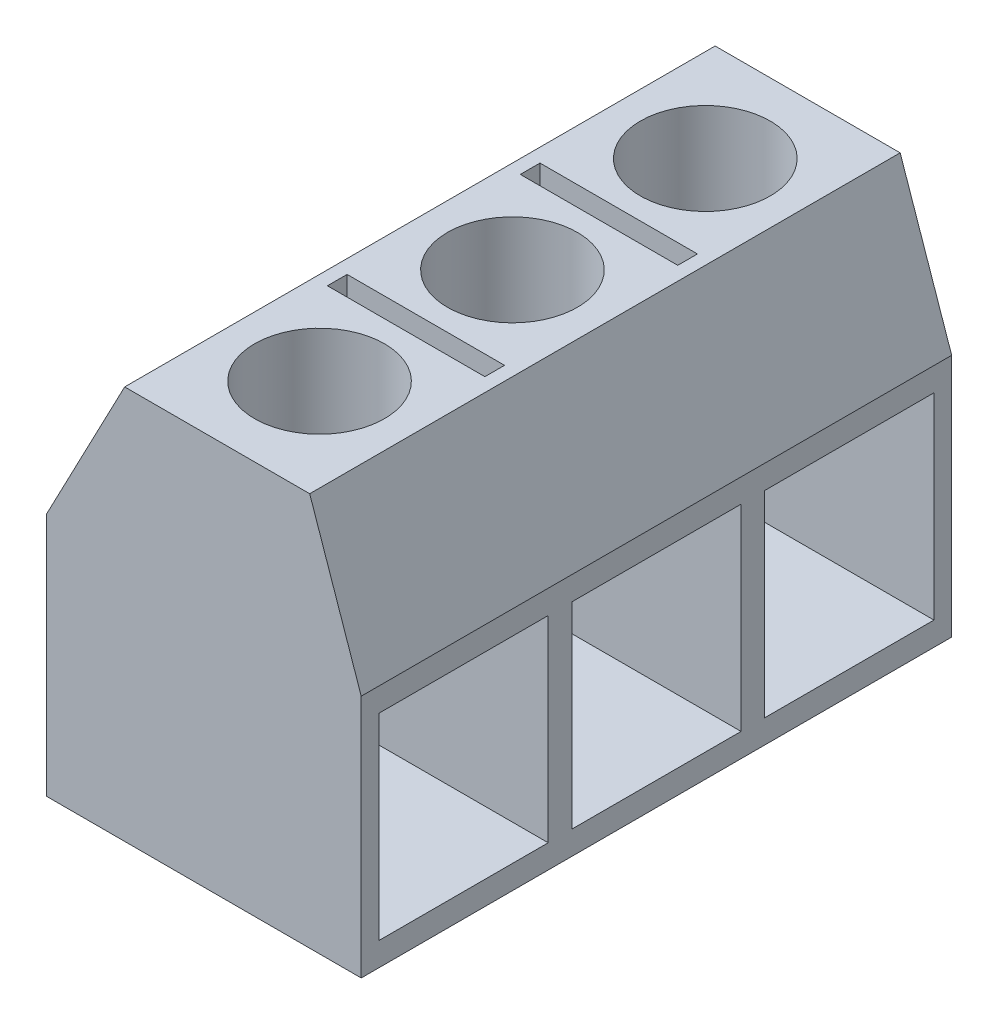
ISO-10303-21;
HEADER;
FILE_DESCRIPTION(('STEP AP214'),'2;1');
FILE_NAME('part.step','',(''),(''),'','','');
FILE_SCHEMA(('AUTOMOTIVE_DESIGN { 1 0 10303 214 1 1 1 1 }'));
ENDSEC;
DATA;
#1=APPLICATION_CONTEXT('core data for automotive mechanical design processes');
#2=APPLICATION_PROTOCOL_DEFINITION('international standard','automotive_design',2000,#1);
#3=PRODUCT_CONTEXT('',#1,'mechanical');
#4=PRODUCT('Part','Part','',(#3));
#5=PRODUCT_RELATED_PRODUCT_CATEGORY('part','',(#4));
#6=PRODUCT_DEFINITION_FORMATION('','',#4);
#7=PRODUCT_DEFINITION_CONTEXT('part definition',#1,'design');
#8=PRODUCT_DEFINITION('design','',#6,#7);
#9=PRODUCT_DEFINITION_SHAPE('','',#8);
#10=(LENGTH_UNIT() NAMED_UNIT(*) SI_UNIT(.MILLI.,.METRE.));
#11=(NAMED_UNIT(*) PLANE_ANGLE_UNIT() SI_UNIT($,.RADIAN.));
#12=(NAMED_UNIT(*) SI_UNIT($,.STERADIAN.) SOLID_ANGLE_UNIT());
#13=UNCERTAINTY_MEASURE_WITH_UNIT(LENGTH_MEASURE(1.E-05),#10,'distance_accuracy_value','');
#14=(GEOMETRIC_REPRESENTATION_CONTEXT(3) GLOBAL_UNCERTAINTY_ASSIGNED_CONTEXT((#13)) GLOBAL_UNIT_ASSIGNED_CONTEXT((#10,
#11,#12)) REPRESENTATION_CONTEXT('',''));
#15=CARTESIAN_POINT('',(0.,0.,0.));
#16=DIRECTION('',(0.,0.,1.));
#17=DIRECTION('',(1.,0.,0.));
#18=AXIS2_PLACEMENT_3D('',#15,#16,#17);
#19=CARTESIAN_POINT('',(-3.80327868852459,6.2,15.));
#20=DIRECTION('',(1.,0.,0.));
#21=DIRECTION('',(0.,1.,0.));
#22=AXIS2_PLACEMENT_3D('',#19,#20,#21);
#23=PLANE('',#22);
#24=DIRECTION('',(0.,-1.,0.));
#25=VECTOR('',#24,1.);
#26=CARTESIAN_POINT('',(-3.80327868852459,6.2,0.));
#27=LINE('',#26,#25);
#28=CARTESIAN_POINT('',(-3.80327868852459,6.2,0.));
#29=VERTEX_POINT('',#28);
#30=CARTESIAN_POINT('',(-3.80327868852458,0.,0.));
#31=VERTEX_POINT('',#30);
#32=EDGE_CURVE('E313',#29,#31,#27,.T.);
#33=ORIENTED_EDGE('',*,*,#32,.T.);
#34=DIRECTION('',(0.,0.,-1.));
#35=VECTOR('',#34,1.);
#36=CARTESIAN_POINT('',(-3.80327868852458,0.,15.));
#37=LINE('',#36,#35);
#38=CARTESIAN_POINT('',(-3.80327868852458,0.,15.));
#39=VERTEX_POINT('',#38);
#40=EDGE_CURVE('E11',#39,#31,#37,.T.);
#41=ORIENTED_EDGE('',*,*,#40,.F.);
#42=DIRECTION('',(0.,-1.,0.));
#43=VECTOR('',#42,1.);
#44=CARTESIAN_POINT('',(-3.80327868852459,6.2,15.));
#45=LINE('',#44,#43);
#46=CARTESIAN_POINT('',(-3.80327868852459,6.2,15.));
#47=VERTEX_POINT('',#46);
#48=EDGE_CURVE('E384',#47,#39,#45,.T.);
#49=ORIENTED_EDGE('',*,*,#48,.F.);
#50=DIRECTION('',(0.,0.,-1.));
#51=VECTOR('',#50,1.);
#52=CARTESIAN_POINT('',(-3.80327868852459,6.2,15.));
#53=LINE('',#52,#51);
#54=EDGE_CURVE('E398',#47,#29,#53,.T.);
#55=ORIENTED_EDGE('',*,*,#54,.T.);
#56=EDGE_LOOP('',(#33,#41,#49,#55));
#57=FACE_BOUND('',#56,.T.);
#58=ADVANCED_FACE('F34',(#57),#23,.F.);
#59=CARTESIAN_POINT('',(-3.80327868852458,0.,15.));
#60=DIRECTION('',(0.,1.,0.));
#61=DIRECTION('',(0.,0.,1.));
#62=AXIS2_PLACEMENT_3D('',#59,#60,#61);
#63=PLANE('',#62);
#64=DIRECTION('',(1.,0.,0.));
#65=VECTOR('',#64,1.);
#66=CARTESIAN_POINT('',(-3.80327868852458,0.,0.));
#67=LINE('',#66,#65);
#68=CARTESIAN_POINT('',(4.19672131147542,0.,0.));
#69=VERTEX_POINT('',#68);
#70=EDGE_CURVE('E401',#31,#69,#67,.T.);
#71=ORIENTED_EDGE('',*,*,#70,.T.);
#72=DIRECTION('',(0.,0.,-1.));
#73=VECTOR('',#72,1.);
#74=CARTESIAN_POINT('',(4.19672131147542,0.,15.));
#75=LINE('',#74,#73);
#76=CARTESIAN_POINT('',(4.19672131147542,0.,15.));
#77=VERTEX_POINT('',#76);
#78=EDGE_CURVE('E42',#77,#69,#75,.T.);
#79=ORIENTED_EDGE('',*,*,#78,.F.);
#80=DIRECTION('',(1.,0.,0.));
#81=VECTOR('',#80,1.);
#82=CARTESIAN_POINT('',(-3.80327868852458,0.,15.));
#83=LINE('',#82,#81);
#84=EDGE_CURVE('E387',#39,#77,#83,.T.);
#85=ORIENTED_EDGE('',*,*,#84,.F.);
#86=ORIENTED_EDGE('',*,*,#40,.T.);
#87=EDGE_LOOP('',(#71,#79,#85,#86));
#88=FACE_BOUND('',#87,.T.);
#89=ADVANCED_FACE('F453',(#88),#63,.F.);
#90=CARTESIAN_POINT('',(4.19672131147542,0.,15.));
#91=DIRECTION('',(-1.,0.,0.));
#92=DIRECTION('',(0.,0.,1.));
#93=AXIS2_PLACEMENT_3D('',#90,#91,#92);
#94=PLANE('',#93);
#95=DIRECTION('',(0.,0.,1.));
#96=VECTOR('',#95,1.);
#97=CARTESIAN_POINT('',(4.19672131147542,5.6,14.55));
#98=LINE('',#97,#96);
#99=CARTESIAN_POINT('',(4.19672131147542,5.6,10.25));
#100=VERTEX_POINT('',#99);
#101=CARTESIAN_POINT('',(4.19672131147542,5.6,14.55));
#102=VERTEX_POINT('',#101);
#103=EDGE_CURVE('E238',#100,#102,#98,.T.);
#104=ORIENTED_EDGE('',*,*,#103,.F.);
#105=DIRECTION('',(0.,1.,0.));
#106=VECTOR('',#105,1.);
#107=CARTESIAN_POINT('',(4.19672131147542,5.6,10.25));
#108=LINE('',#107,#106);
#109=CARTESIAN_POINT('',(4.19672131147542,0.599999999999999,10.25));
#110=VERTEX_POINT('',#109);
#111=EDGE_CURVE('E50',#110,#100,#108,.T.);
#112=ORIENTED_EDGE('',*,*,#111,.F.);
#113=DIRECTION('',(0.,0.,-1.));
#114=VECTOR('',#113,1.);
#115=CARTESIAN_POINT('',(4.19672131147542,0.599999999999999,14.55));
#116=LINE('',#115,#114);
#117=CARTESIAN_POINT('',(4.19672131147542,0.599999999999999,14.55));
#118=VERTEX_POINT('',#117);
#119=EDGE_CURVE('E229',#118,#110,#116,.T.);
#120=ORIENTED_EDGE('',*,*,#119,.F.);
#121=DIRECTION('',(0.,-1.,0.));
#122=VECTOR('',#121,1.);
#123=CARTESIAN_POINT('',(4.19672131147542,5.6,14.55));
#124=LINE('',#123,#122);
#125=EDGE_CURVE('E232',#102,#118,#124,.T.);
#126=ORIENTED_EDGE('',*,*,#125,.F.);
#127=EDGE_LOOP('',(#104,#112,#120,#126));
#128=FACE_BOUND('',#127,.T.);
#129=DIRECTION('',(0.,1.,0.));
#130=VECTOR('',#129,1.);
#131=CARTESIAN_POINT('',(4.19672131147542,5.6,5.35));
#132=LINE('',#131,#130);
#133=CARTESIAN_POINT('',(4.19672131147542,0.6,5.35));
#134=VERTEX_POINT('',#133);
#135=CARTESIAN_POINT('',(4.19672131147542,5.6,5.35));
#136=VERTEX_POINT('',#135);
#137=EDGE_CURVE('E264',#134,#136,#132,.T.);
#138=ORIENTED_EDGE('',*,*,#137,.F.);
#139=DIRECTION('',(0.,0.,-1.));
#140=VECTOR('',#139,1.);
#141=CARTESIAN_POINT('',(4.19672131147542,0.599999999999999,9.65));
#142=LINE('',#141,#140);
#143=CARTESIAN_POINT('',(4.19672131147542,0.599999999999999,9.65));
#144=VERTEX_POINT('',#143);
#145=EDGE_CURVE('E58',#144,#134,#142,.T.);
#146=ORIENTED_EDGE('',*,*,#145,.F.);
#147=DIRECTION('',(0.,-1.,0.));
#148=VECTOR('',#147,1.);
#149=CARTESIAN_POINT('',(4.19672131147542,5.6,9.65));
#150=LINE('',#149,#148);
#151=CARTESIAN_POINT('',(4.19672131147542,5.6,9.65));
#152=VERTEX_POINT('',#151);
#153=EDGE_CURVE('E253',#152,#144,#150,.T.);
#154=ORIENTED_EDGE('',*,*,#153,.F.);
#155=DIRECTION('',(0.,0.,1.));
#156=VECTOR('',#155,1.);
#157=CARTESIAN_POINT('',(4.19672131147542,5.6,9.65));
#158=LINE('',#157,#156);
#159=EDGE_CURVE('E268',#136,#152,#158,.T.);
#160=ORIENTED_EDGE('',*,*,#159,.F.);
#161=EDGE_LOOP('',(#138,#146,#154,#160));
#162=FACE_BOUND('',#161,.T.);
#163=DIRECTION('',(0.,1.,0.));
#164=VECTOR('',#163,1.);
#165=CARTESIAN_POINT('',(4.19672131147542,5.6,0.449999999999996));
#166=LINE('',#165,#164);
#167=CARTESIAN_POINT('',(4.19672131147542,0.599999999999999,0.449999999999996));
#168=VERTEX_POINT('',#167);
#169=CARTESIAN_POINT('',(4.19672131147542,5.6,0.449999999999996));
#170=VERTEX_POINT('',#169);
#171=EDGE_CURVE('E295',#168,#170,#166,.T.);
#172=ORIENTED_EDGE('',*,*,#171,.F.);
#173=DIRECTION('',(0.,0.,-1.));
#174=VECTOR('',#173,1.);
#175=CARTESIAN_POINT('',(4.19672131147542,0.599999999999999,4.75));
#176=LINE('',#175,#174);
#177=CARTESIAN_POINT('',(4.19672131147542,0.599999999999999,4.75));
#178=VERTEX_POINT('',#177);
#179=EDGE_CURVE('E293',#178,#168,#176,.T.);
#180=ORIENTED_EDGE('',*,*,#179,.F.);
#181=DIRECTION('',(0.,-1.,0.));
#182=VECTOR('',#181,1.);
#183=CARTESIAN_POINT('',(4.19672131147542,5.6,4.75));
#184=LINE('',#183,#182);
#185=CARTESIAN_POINT('',(4.19672131147542,5.6,4.75));
#186=VERTEX_POINT('',#185);
#187=EDGE_CURVE('E283',#186,#178,#184,.T.);
#188=ORIENTED_EDGE('',*,*,#187,.F.);
#189=DIRECTION('',(0.,0.,1.));
#190=VECTOR('',#189,1.);
#191=CARTESIAN_POINT('',(4.19672131147542,5.6,4.75));
#192=LINE('',#191,#190);
#193=EDGE_CURVE('E298',#170,#186,#192,.T.);
#194=ORIENTED_EDGE('',*,*,#193,.F.);
#195=EDGE_LOOP('',(#172,#180,#188,#194));
#196=FACE_BOUND('',#195,.T.);
#197=DIRECTION('',(0.,1.,0.));
#198=VECTOR('',#197,1.);
#199=CARTESIAN_POINT('',(4.19672131147542,0.,0.));
#200=LINE('',#199,#198);
#201=CARTESIAN_POINT('',(4.19672131147542,6.2,0.));
#202=VERTEX_POINT('',#201);
#203=EDGE_CURVE('E403',#69,#202,#200,.T.);
#204=ORIENTED_EDGE('',*,*,#203,.T.);
#205=DIRECTION('',(0.,0.,-1.));
#206=VECTOR('',#205,1.);
#207=CARTESIAN_POINT('',(4.19672131147542,6.2,15.));
#208=LINE('',#207,#206);
#209=CARTESIAN_POINT('',(4.19672131147542,6.2,15.));
#210=VERTEX_POINT('',#209);
#211=EDGE_CURVE('E418',#210,#202,#208,.T.);
#212=ORIENTED_EDGE('',*,*,#211,.F.);
#213=DIRECTION('',(0.,1.,0.));
#214=VECTOR('',#213,1.);
#215=CARTESIAN_POINT('',(4.19672131147542,0.,15.));
#216=LINE('',#215,#214);
#217=EDGE_CURVE('E390',#77,#210,#216,.T.);
#218=ORIENTED_EDGE('',*,*,#217,.F.);
#219=ORIENTED_EDGE('',*,*,#78,.T.);
#220=EDGE_LOOP('',(#204,#212,#218,#219));
#221=FACE_BOUND('',#220,.T.);
#222=ADVANCED_FACE('F458',(#128,#162,#196,#221),#94,.F.);
#223=CARTESIAN_POINT('',(4.19672131147542,6.2,15.));
#224=DIRECTION('',(-0.945476419668395,-0.325690558430901,0.));
#225=DIRECTION('',(0.325690558430901,-0.945476419668395,0.));
#226=AXIS2_PLACEMENT_3D('',#223,#224,#225);
#227=PLANE('',#226);
#228=DIRECTION('',(-0.325690558430901,0.945476419668395,0.));
#229=VECTOR('',#228,1.);
#230=CARTESIAN_POINT('',(4.19672131147542,6.2,0.));
#231=LINE('',#230,#229);
#232=CARTESIAN_POINT('',(2.88772608294132,10.,0.));
#233=VERTEX_POINT('',#232);
#234=EDGE_CURVE('E405',#202,#233,#231,.T.);
#235=ORIENTED_EDGE('',*,*,#234,.T.);
#236=DIRECTION('',(0.,0.,-1.));
#237=VECTOR('',#236,1.);
#238=CARTESIAN_POINT('',(2.88772608294132,10.,15.));
#239=LINE('',#238,#237);
#240=CARTESIAN_POINT('',(2.88772608294132,10.,15.));
#241=VERTEX_POINT('',#240);
#242=EDGE_CURVE('E415',#241,#233,#239,.T.);
#243=ORIENTED_EDGE('',*,*,#242,.F.);
#244=DIRECTION('',(-0.325690558430901,0.945476419668395,0.));
#245=VECTOR('',#244,1.);
#246=CARTESIAN_POINT('',(4.19672131147542,6.2,15.));
#247=LINE('',#246,#245);
#248=EDGE_CURVE('E392',#210,#241,#247,.T.);
#249=ORIENTED_EDGE('',*,*,#248,.F.);
#250=ORIENTED_EDGE('',*,*,#211,.T.);
#251=EDGE_LOOP('',(#235,#243,#249,#250));
#252=FACE_BOUND('',#251,.T.);
#253=ADVANCED_FACE('F483',(#252),#227,.F.);
#254=CARTESIAN_POINT('',(2.88772608294132,10.,15.));
#255=DIRECTION('',(0.,-1.,0.));
#256=DIRECTION('',(1.,0.,0.));
#257=AXIS2_PLACEMENT_3D('',#254,#255,#256);
#258=PLANE('',#257);
#259=CARTESIAN_POINT('',(0.537726082941324,10.,12.4));
#260=DIRECTION('',(0.,1.,0.));
#261=DIRECTION('',(-1.,0.,0.));
#262=AXIS2_PLACEMENT_3D('',#259,#260,#261);
#263=CIRCLE('',#262,1.65);
#264=CARTESIAN_POINT('',(-1.11227391705868,10.,12.4));
#265=VERTEX_POINT('',#264);
#266=EDGE_CURVE('E310',#265,#265,#263,.T.);
#267=ORIENTED_EDGE('',*,*,#266,.F.);
#268=EDGE_LOOP('',(#267));
#269=FACE_BOUND('',#268,.T.);
#270=DIRECTION('',(1.,0.,0.));
#271=VECTOR('',#270,1.);
#272=CARTESIAN_POINT('',(-1.46227391705868,10.,10.2));
#273=LINE('',#272,#271);
#274=CARTESIAN_POINT('',(-1.46227391705868,10.,10.2));
#275=VERTEX_POINT('',#274);
#276=CARTESIAN_POINT('',(2.53772608294132,10.,10.2));
#277=VERTEX_POINT('',#276);
#278=EDGE_CURVE('E331',#275,#277,#273,.T.);
#279=ORIENTED_EDGE('',*,*,#278,.F.);
#280=DIRECTION('',(0.,0.,1.));
#281=VECTOR('',#280,1.);
#282=CARTESIAN_POINT('',(-1.46227391705868,10.,10.2));
#283=LINE('',#282,#281);
#284=CARTESIAN_POINT('',(-1.46227391705868,10.,9.7));
#285=VERTEX_POINT('',#284);
#286=EDGE_CURVE('E329',#285,#275,#283,.T.);
#287=ORIENTED_EDGE('',*,*,#286,.F.);
#288=DIRECTION('',(-1.,0.,0.));
#289=VECTOR('',#288,1.);
#290=CARTESIAN_POINT('',(-1.46227391705868,10.,9.7));
#291=LINE('',#290,#289);
#292=CARTESIAN_POINT('',(2.53772608294132,10.,9.7));
#293=VERTEX_POINT('',#292);
#294=EDGE_CURVE('E319',#293,#285,#291,.T.);
#295=ORIENTED_EDGE('',*,*,#294,.F.);
#296=DIRECTION('',(0.,0.,-1.));
#297=VECTOR('',#296,1.);
#298=CARTESIAN_POINT('',(2.53772608294132,10.,10.2));
#299=LINE('',#298,#297);
#300=EDGE_CURVE('E335',#277,#293,#299,.T.);
#301=ORIENTED_EDGE('',*,*,#300,.F.);
#302=EDGE_LOOP('',(#279,#287,#295,#301));
#303=FACE_BOUND('',#302,.T.);
#304=CARTESIAN_POINT('',(0.537726082941324,10.,7.5));
#305=DIRECTION('',(0.,1.,0.));
#306=DIRECTION('',(-1.,0.,0.));
#307=AXIS2_PLACEMENT_3D('',#304,#305,#306);
#308=CIRCLE('',#307,1.65);
#309=CARTESIAN_POINT('',(-1.11227391705868,10.,7.5));
#310=VERTEX_POINT('',#309);
#311=EDGE_CURVE('E332',#310,#310,#308,.T.);
#312=ORIENTED_EDGE('',*,*,#311,.F.);
#313=EDGE_LOOP('',(#312));
#314=FACE_BOUND('',#313,.T.);
#315=DIRECTION('',(1.,0.,0.));
#316=VECTOR('',#315,1.);
#317=CARTESIAN_POINT('',(-1.46227391705868,10.,5.3));
#318=LINE('',#317,#316);
#319=CARTESIAN_POINT('',(-1.46227391705868,10.,5.3));
#320=VERTEX_POINT('',#319);
#321=CARTESIAN_POINT('',(2.53772608294132,10.,5.3));
#322=VERTEX_POINT('',#321);
#323=EDGE_CURVE('E366',#320,#322,#318,.T.);
#324=ORIENTED_EDGE('',*,*,#323,.F.);
#325=DIRECTION('',(0.,0.,1.));
#326=VECTOR('',#325,1.);
#327=CARTESIAN_POINT('',(-1.46227391705868,10.,5.3));
#328=LINE('',#327,#326);
#329=CARTESIAN_POINT('',(-1.46227391705868,10.,4.8));
#330=VERTEX_POINT('',#329);
#331=EDGE_CURVE('E364',#330,#320,#328,.T.);
#332=ORIENTED_EDGE('',*,*,#331,.F.);
#333=DIRECTION('',(-1.,0.,0.));
#334=VECTOR('',#333,1.);
#335=CARTESIAN_POINT('',(-1.46227391705868,10.,4.8));
#336=LINE('',#335,#334);
#337=CARTESIAN_POINT('',(2.53772608294132,10.,4.8));
#338=VERTEX_POINT('',#337);
#339=EDGE_CURVE('E354',#338,#330,#336,.T.);
#340=ORIENTED_EDGE('',*,*,#339,.F.);
#341=DIRECTION('',(0.,0.,-1.));
#342=VECTOR('',#341,1.);
#343=CARTESIAN_POINT('',(2.53772608294132,10.,5.3));
#344=LINE('',#343,#342);
#345=EDGE_CURVE('E370',#322,#338,#344,.T.);
#346=ORIENTED_EDGE('',*,*,#345,.F.);
#347=EDGE_LOOP('',(#324,#332,#340,#346));
#348=FACE_BOUND('',#347,.T.);
#349=CARTESIAN_POINT('',(0.537726082941324,10.,2.6));
#350=DIRECTION('',(0.,1.,0.));
#351=DIRECTION('',(-1.,0.,0.));
#352=AXIS2_PLACEMENT_3D('',#349,#350,#351);
#353=CIRCLE('',#352,1.65);
#354=CARTESIAN_POINT('',(-1.11227391705868,10.,2.6));
#355=VERTEX_POINT('',#354);
#356=EDGE_CURVE('E367',#355,#355,#353,.T.);
#357=ORIENTED_EDGE('',*,*,#356,.F.);
#358=EDGE_LOOP('',(#357));
#359=FACE_BOUND('',#358,.T.);
#360=DIRECTION('',(-1.,0.,0.));
#361=VECTOR('',#360,1.);
#362=CARTESIAN_POINT('',(2.88772608294132,10.,0.));
#363=LINE('',#362,#361);
#364=CARTESIAN_POINT('',(-1.81227391705868,10.,0.));
#365=VERTEX_POINT('',#364);
#366=EDGE_CURVE('E407',#233,#365,#363,.T.);
#367=ORIENTED_EDGE('',*,*,#366,.T.);
#368=DIRECTION('',(0.,0.,-1.));
#369=VECTOR('',#368,1.);
#370=CARTESIAN_POINT('',(-1.81227391705868,10.,15.));
#371=LINE('',#370,#369);
#372=CARTESIAN_POINT('',(-1.81227391705868,10.,15.));
#373=VERTEX_POINT('',#372);
#374=EDGE_CURVE('E412',#373,#365,#371,.T.);
#375=ORIENTED_EDGE('',*,*,#374,.F.);
#376=DIRECTION('',(-1.,0.,0.));
#377=VECTOR('',#376,1.);
#378=CARTESIAN_POINT('',(2.88772608294132,10.,15.));
#379=LINE('',#378,#377);
#380=EDGE_CURVE('E394',#241,#373,#379,.T.);
#381=ORIENTED_EDGE('',*,*,#380,.F.);
#382=ORIENTED_EDGE('',*,*,#242,.T.);
#383=EDGE_LOOP('',(#367,#375,#381,#382));
#384=FACE_BOUND('',#383,.T.);
#385=ADVANCED_FACE('F480',(#269,#303,#314,#348,#359,#384),#258,.F.);
#386=CARTESIAN_POINT('',(-1.81227391705868,10.,15.));
#387=DIRECTION('',(0.885780885780885,-0.46410367633238,0.));
#388=DIRECTION('',(0.46410367633238,0.885780885780885,0.));
#389=AXIS2_PLACEMENT_3D('',#386,#387,#388);
#390=PLANE('',#389);
#391=DIRECTION('',(-0.46410367633238,-0.885780885780885,0.));
#392=VECTOR('',#391,1.);
#393=CARTESIAN_POINT('',(-1.81227391705868,10.,0.));
#394=LINE('',#393,#392);
#395=EDGE_CURVE('E388',#365,#29,#394,.T.);
#396=ORIENTED_EDGE('',*,*,#395,.T.);
#397=ORIENTED_EDGE('',*,*,#54,.F.);
#398=DIRECTION('',(-0.46410367633238,-0.885780885780885,0.));
#399=VECTOR('',#398,1.);
#400=CARTESIAN_POINT('',(-1.81227391705868,10.,15.));
#401=LINE('',#400,#399);
#402=EDGE_CURVE('E396',#373,#47,#401,.T.);
#403=ORIENTED_EDGE('',*,*,#402,.F.);
#404=ORIENTED_EDGE('',*,*,#374,.T.);
#405=EDGE_LOOP('',(#396,#397,#403,#404));
#406=FACE_BOUND('',#405,.T.);
#407=ADVANCED_FACE('F478',(#406),#390,.F.);
#408=CARTESIAN_POINT('',(0.,0.,15.));
#409=DIRECTION('',(0.,0.,1.));
#410=DIRECTION('',(1.,0.,0.));
#411=AXIS2_PLACEMENT_3D('',#408,#409,#410);
#412=PLANE('',#411);
#413=ORIENTED_EDGE('',*,*,#48,.T.);
#414=ORIENTED_EDGE('',*,*,#84,.T.);
#415=ORIENTED_EDGE('',*,*,#217,.T.);
#416=ORIENTED_EDGE('',*,*,#248,.T.);
#417=ORIENTED_EDGE('',*,*,#380,.T.);
#418=ORIENTED_EDGE('',*,*,#402,.T.);
#419=EDGE_LOOP('',(#413,#414,#415,#416,#417,#418));
#420=FACE_BOUND('',#419,.T.);
#421=ADVANCED_FACE('F473',(#420),#412,.T.);
#422=CARTESIAN_POINT('',(0.,0.,0.));
#423=DIRECTION('',(0.,0.,1.));
#424=DIRECTION('',(1.,0.,0.));
#425=AXIS2_PLACEMENT_3D('',#422,#423,#424);
#426=PLANE('',#425);
#427=ORIENTED_EDGE('',*,*,#32,.F.);
#428=ORIENTED_EDGE('',*,*,#395,.F.);
#429=ORIENTED_EDGE('',*,*,#366,.F.);
#430=ORIENTED_EDGE('',*,*,#234,.F.);
#431=ORIENTED_EDGE('',*,*,#203,.F.);
#432=ORIENTED_EDGE('',*,*,#70,.F.);
#433=EDGE_LOOP('',(#427,#428,#429,#430,#431,#432));
#434=FACE_BOUND('',#433,.T.);
#435=ADVANCED_FACE('F466',(#434),#426,.F.);
#436=CARTESIAN_POINT('',(0.537726082941328,0.799999999999999,2.6));
#437=DIRECTION('',(0.,1.,0.));
#438=DIRECTION('',(-1.,0.,0.));
#439=AXIS2_PLACEMENT_3D('',#436,#437,#438);
#440=CYLINDRICAL_SURFACE('',#439,1.65);
#441=CARTESIAN_POINT('',(0.537726082941326,5.6,2.6));
#442=DIRECTION('',(0.,1.,0.));
#443=DIRECTION('',(0.,0.,1.));
#444=AXIS2_PLACEMENT_3D('',#441,#442,#443);
#445=CIRCLE('',#444,1.65);
#446=CARTESIAN_POINT('',(0.537726082941326,5.6,4.25));
#447=VERTEX_POINT('',#446);
#448=EDGE_CURVE('E37',#447,#447,#445,.F.);
#449=ORIENTED_EDGE('',*,*,#448,.T.);
#450=EDGE_LOOP('',(#449));
#451=FACE_BOUND('',#450,.T.);
#452=ORIENTED_EDGE('',*,*,#356,.T.);
#453=EDGE_LOOP('',(#452));
#454=FACE_BOUND('',#453,.T.);
#455=ADVANCED_FACE('F431',(#451,#454),#440,.F.);
#456=CARTESIAN_POINT('',(-1.46227391705867,0.799999999999999,5.3));
#457=DIRECTION('',(-1.,0.,0.));
#458=DIRECTION('',(0.,-1.,0.));
#459=AXIS2_PLACEMENT_3D('',#456,#457,#458);
#460=PLANE('',#459);
#461=ORIENTED_EDGE('',*,*,#331,.T.);
#462=DIRECTION('',(0.,1.,0.));
#463=VECTOR('',#462,1.);
#464=CARTESIAN_POINT('',(-1.46227391705867,0.799999999999999,5.3));
#465=LINE('',#464,#463);
#466=CARTESIAN_POINT('',(-1.46227391705867,0.799999999999999,5.3));
#467=VERTEX_POINT('',#466);
#468=EDGE_CURVE('E363',#467,#320,#465,.T.);
#469=ORIENTED_EDGE('',*,*,#468,.F.);
#470=DIRECTION('',(0.,0.,1.));
#471=VECTOR('',#470,1.);
#472=CARTESIAN_POINT('',(-1.46227391705867,0.799999999999999,5.3));
#473=LINE('',#472,#471);
#474=CARTESIAN_POINT('',(-1.46227391705867,0.799999999999999,4.8));
#475=VERTEX_POINT('',#474);
#476=EDGE_CURVE('E350',#475,#467,#473,.T.);
#477=ORIENTED_EDGE('',*,*,#476,.F.);
#478=DIRECTION('',(0.,1.,0.));
#479=VECTOR('',#478,1.);
#480=CARTESIAN_POINT('',(-1.46227391705867,0.799999999999999,4.8));
#481=LINE('',#480,#479);
#482=EDGE_CURVE('E349',#475,#330,#481,.T.);
#483=ORIENTED_EDGE('',*,*,#482,.T.);
#484=EDGE_LOOP('',(#461,#469,#477,#483));
#485=FACE_BOUND('',#484,.T.);
#486=ADVANCED_FACE('F507',(#485),#460,.F.);
#487=CARTESIAN_POINT('',(-1.46227391705867,0.799999999999999,4.8));
#488=DIRECTION('',(0.,0.,-1.));
#489=DIRECTION('',(-1.,0.,0.));
#490=AXIS2_PLACEMENT_3D('',#487,#488,#489);
#491=PLANE('',#490);
#492=ORIENTED_EDGE('',*,*,#339,.T.);
#493=ORIENTED_EDGE('',*,*,#482,.F.);
#494=DIRECTION('',(-1.,0.,0.));
#495=VECTOR('',#494,1.);
#496=CARTESIAN_POINT('',(-1.46227391705867,0.799999999999999,4.8));
#497=LINE('',#496,#495);
#498=CARTESIAN_POINT('',(2.53772608294133,0.8,4.8));
#499=VERTEX_POINT('',#498);
#500=EDGE_CURVE('E360',#499,#475,#497,.T.);
#501=ORIENTED_EDGE('',*,*,#500,.F.);
#502=DIRECTION('',(0.,1.,0.));
#503=VECTOR('',#502,1.);
#504=CARTESIAN_POINT('',(2.53772608294133,0.8,4.8));
#505=LINE('',#504,#503);
#506=EDGE_CURVE('E376',#499,#338,#505,.T.);
#507=ORIENTED_EDGE('',*,*,#506,.T.);
#508=EDGE_LOOP('',(#492,#493,#501,#507));
#509=FACE_BOUND('',#508,.T.);
#510=ADVANCED_FACE('F510',(#509),#491,.F.);
#511=CARTESIAN_POINT('',(2.53772608294133,0.8,5.3));
#512=DIRECTION('',(1.,0.,0.));
#513=DIRECTION('',(0.,1.,0.));
#514=AXIS2_PLACEMENT_3D('',#511,#512,#513);
#515=PLANE('',#514);
#516=ORIENTED_EDGE('',*,*,#345,.T.);
#517=ORIENTED_EDGE('',*,*,#506,.F.);
#518=DIRECTION('',(0.,0.,-1.));
#519=VECTOR('',#518,1.);
#520=CARTESIAN_POINT('',(2.53772608294133,0.8,5.3));
#521=LINE('',#520,#519);
#522=CARTESIAN_POINT('',(2.53772608294133,0.8,5.3));
#523=VERTEX_POINT('',#522);
#524=EDGE_CURVE('E357',#523,#499,#521,.T.);
#525=ORIENTED_EDGE('',*,*,#524,.F.);
#526=DIRECTION('',(0.,1.,0.));
#527=VECTOR('',#526,1.);
#528=CARTESIAN_POINT('',(2.53772608294133,0.8,5.3));
#529=LINE('',#528,#527);
#530=EDGE_CURVE('E378',#523,#322,#529,.T.);
#531=ORIENTED_EDGE('',*,*,#530,.T.);
#532=EDGE_LOOP('',(#516,#517,#525,#531));
#533=FACE_BOUND('',#532,.T.);
#534=ADVANCED_FACE('F516',(#533),#515,.F.);
#535=CARTESIAN_POINT('',(-1.46227391705867,0.799999999999999,5.3));
#536=DIRECTION('',(0.,0.,1.));
#537=DIRECTION('',(1.,0.,0.));
#538=AXIS2_PLACEMENT_3D('',#535,#536,#537);
#539=PLANE('',#538);
#540=ORIENTED_EDGE('',*,*,#323,.T.);
#541=ORIENTED_EDGE('',*,*,#530,.F.);
#542=DIRECTION('',(1.,0.,0.));
#543=VECTOR('',#542,1.);
#544=CARTESIAN_POINT('',(-1.46227391705867,0.799999999999999,5.3));
#545=LINE('',#544,#543);
#546=EDGE_CURVE('E353',#467,#523,#545,.T.);
#547=ORIENTED_EDGE('',*,*,#546,.F.);
#548=ORIENTED_EDGE('',*,*,#468,.T.);
#549=EDGE_LOOP('',(#540,#541,#547,#548));
#550=FACE_BOUND('',#549,.T.);
#551=ADVANCED_FACE('F512',(#550),#539,.F.);
#552=CARTESIAN_POINT('',(0.,0.799999999999999,0.));
#553=DIRECTION('',(0.,-1.,0.));
#554=DIRECTION('',(1.,0.,0.));
#555=AXIS2_PLACEMENT_3D('',#552,#553,#554);
#556=PLANE('',#555);
#557=ORIENTED_EDGE('',*,*,#476,.T.);
#558=ORIENTED_EDGE('',*,*,#546,.T.);
#559=ORIENTED_EDGE('',*,*,#524,.T.);
#560=ORIENTED_EDGE('',*,*,#500,.T.);
#561=EDGE_LOOP('',(#557,#558,#559,#560));
#562=FACE_BOUND('',#561,.T.);
#563=ADVANCED_FACE('F515',(#562),#556,.F.);
#564=CARTESIAN_POINT('',(0.537726082941328,0.799999999999999,7.5));
#565=DIRECTION('',(0.,1.,0.));
#566=DIRECTION('',(-1.,0.,0.));
#567=AXIS2_PLACEMENT_3D('',#564,#565,#566);
#568=CYLINDRICAL_SURFACE('',#567,1.65);
#569=CARTESIAN_POINT('',(0.537726082941326,5.6,7.5));
#570=DIRECTION('',(0.,1.,0.));
#571=DIRECTION('',(0.,0.,1.));
#572=AXIS2_PLACEMENT_3D('',#569,#570,#571);
#573=CIRCLE('',#572,1.65);
#574=CARTESIAN_POINT('',(0.537726082941326,5.6,9.15));
#575=VERTEX_POINT('',#574);
#576=EDGE_CURVE('E424',#575,#575,#573,.F.);
#577=ORIENTED_EDGE('',*,*,#576,.T.);
#578=EDGE_LOOP('',(#577));
#579=FACE_BOUND('',#578,.T.);
#580=ORIENTED_EDGE('',*,*,#311,.T.);
#581=EDGE_LOOP('',(#580));
#582=FACE_BOUND('',#581,.T.);
#583=ADVANCED_FACE('F526',(#579,#582),#568,.F.);
#584=CARTESIAN_POINT('',(-1.46227391705867,0.799999999999999,10.2));
#585=DIRECTION('',(-1.,0.,0.));
#586=DIRECTION('',(0.,-1.,0.));
#587=AXIS2_PLACEMENT_3D('',#584,#585,#586);
#588=PLANE('',#587);
#589=ORIENTED_EDGE('',*,*,#286,.T.);
#590=DIRECTION('',(0.,1.,0.));
#591=VECTOR('',#590,1.);
#592=CARTESIAN_POINT('',(-1.46227391705867,0.799999999999999,10.2));
#593=LINE('',#592,#591);
#594=CARTESIAN_POINT('',(-1.46227391705867,0.799999999999999,10.2));
#595=VERTEX_POINT('',#594);
#596=EDGE_CURVE('E328',#595,#275,#593,.T.);
#597=ORIENTED_EDGE('',*,*,#596,.F.);
#598=DIRECTION('',(0.,0.,1.));
#599=VECTOR('',#598,1.);
#600=CARTESIAN_POINT('',(-1.46227391705867,0.799999999999999,10.2));
#601=LINE('',#600,#599);
#602=CARTESIAN_POINT('',(-1.46227391705867,0.799999999999999,9.7));
#603=VERTEX_POINT('',#602);
#604=EDGE_CURVE('E315',#603,#595,#601,.T.);
#605=ORIENTED_EDGE('',*,*,#604,.F.);
#606=DIRECTION('',(0.,1.,0.));
#607=VECTOR('',#606,1.);
#608=CARTESIAN_POINT('',(-1.46227391705867,0.799999999999999,9.7));
#609=LINE('',#608,#607);
#610=EDGE_CURVE('E314',#603,#285,#609,.T.);
#611=ORIENTED_EDGE('',*,*,#610,.T.);
#612=EDGE_LOOP('',(#589,#597,#605,#611));
#613=FACE_BOUND('',#612,.T.);
#614=ADVANCED_FACE('F530',(#613),#588,.F.);
#615=CARTESIAN_POINT('',(-1.46227391705867,0.799999999999999,9.7));
#616=DIRECTION('',(0.,0.,-1.));
#617=DIRECTION('',(-1.,0.,0.));
#618=AXIS2_PLACEMENT_3D('',#615,#616,#617);
#619=PLANE('',#618);
#620=ORIENTED_EDGE('',*,*,#294,.T.);
#621=ORIENTED_EDGE('',*,*,#610,.F.);
#622=DIRECTION('',(-1.,0.,0.));
#623=VECTOR('',#622,1.);
#624=CARTESIAN_POINT('',(-1.46227391705867,0.799999999999999,9.7));
#625=LINE('',#624,#623);
#626=CARTESIAN_POINT('',(2.53772608294133,0.8,9.7));
#627=VERTEX_POINT('',#626);
#628=EDGE_CURVE('E325',#627,#603,#625,.T.);
#629=ORIENTED_EDGE('',*,*,#628,.F.);
#630=DIRECTION('',(0.,1.,0.));
#631=VECTOR('',#630,1.);
#632=CARTESIAN_POINT('',(2.53772608294133,0.8,9.7));
#633=LINE('',#632,#631);
#634=EDGE_CURVE('E341',#627,#293,#633,.T.);
#635=ORIENTED_EDGE('',*,*,#634,.T.);
#636=EDGE_LOOP('',(#620,#621,#629,#635));
#637=FACE_BOUND('',#636,.T.);
#638=ADVANCED_FACE('F533',(#637),#619,.F.);
#639=CARTESIAN_POINT('',(2.53772608294133,0.8,10.2));
#640=DIRECTION('',(1.,0.,0.));
#641=DIRECTION('',(0.,1.,0.));
#642=AXIS2_PLACEMENT_3D('',#639,#640,#641);
#643=PLANE('',#642);
#644=ORIENTED_EDGE('',*,*,#300,.T.);
#645=ORIENTED_EDGE('',*,*,#634,.F.);
#646=DIRECTION('',(0.,0.,-1.));
#647=VECTOR('',#646,1.);
#648=CARTESIAN_POINT('',(2.53772608294133,0.8,10.2));
#649=LINE('',#648,#647);
#650=CARTESIAN_POINT('',(2.53772608294133,0.8,10.2));
#651=VERTEX_POINT('',#650);
#652=EDGE_CURVE('E322',#651,#627,#649,.T.);
#653=ORIENTED_EDGE('',*,*,#652,.F.);
#654=DIRECTION('',(0.,1.,0.));
#655=VECTOR('',#654,1.);
#656=CARTESIAN_POINT('',(2.53772608294133,0.8,10.2));
#657=LINE('',#656,#655);
#658=EDGE_CURVE('E343',#651,#277,#657,.T.);
#659=ORIENTED_EDGE('',*,*,#658,.T.);
#660=EDGE_LOOP('',(#644,#645,#653,#659));
#661=FACE_BOUND('',#660,.T.);
#662=ADVANCED_FACE('F539',(#661),#643,.F.);
#663=CARTESIAN_POINT('',(-1.46227391705867,0.799999999999999,10.2));
#664=DIRECTION('',(0.,0.,1.));
#665=DIRECTION('',(1.,0.,0.));
#666=AXIS2_PLACEMENT_3D('',#663,#664,#665);
#667=PLANE('',#666);
#668=ORIENTED_EDGE('',*,*,#278,.T.);
#669=ORIENTED_EDGE('',*,*,#658,.F.);
#670=DIRECTION('',(1.,0.,0.));
#671=VECTOR('',#670,1.);
#672=CARTESIAN_POINT('',(-1.46227391705867,0.799999999999999,10.2));
#673=LINE('',#672,#671);
#674=EDGE_CURVE('E318',#595,#651,#673,.T.);
#675=ORIENTED_EDGE('',*,*,#674,.F.);
#676=ORIENTED_EDGE('',*,*,#596,.T.);
#677=EDGE_LOOP('',(#668,#669,#675,#676));
#678=FACE_BOUND('',#677,.T.);
#679=ADVANCED_FACE('F535',(#678),#667,.F.);
#680=CARTESIAN_POINT('',(0.,0.799999999999999,0.));
#681=DIRECTION('',(0.,-1.,0.));
#682=DIRECTION('',(1.,0.,0.));
#683=AXIS2_PLACEMENT_3D('',#680,#681,#682);
#684=PLANE('',#683);
#685=ORIENTED_EDGE('',*,*,#604,.T.);
#686=ORIENTED_EDGE('',*,*,#674,.T.);
#687=ORIENTED_EDGE('',*,*,#652,.T.);
#688=ORIENTED_EDGE('',*,*,#628,.T.);
#689=EDGE_LOOP('',(#685,#686,#687,#688));
#690=FACE_BOUND('',#689,.T.);
#691=ADVANCED_FACE('F538',(#690),#684,.F.);
#692=CARTESIAN_POINT('',(0.537726082941328,0.799999999999999,12.4));
#693=DIRECTION('',(0.,1.,0.));
#694=DIRECTION('',(-1.,0.,0.));
#695=AXIS2_PLACEMENT_3D('',#692,#693,#694);
#696=CYLINDRICAL_SURFACE('',#695,1.65);
#697=CARTESIAN_POINT('',(0.537726082941326,5.6,12.4));
#698=DIRECTION('',(0.,1.,0.));
#699=DIRECTION('',(0.,0.,1.));
#700=AXIS2_PLACEMENT_3D('',#697,#698,#699);
#701=CIRCLE('',#700,1.65);
#702=CARTESIAN_POINT('',(0.537726082941326,5.6,14.05));
#703=VERTEX_POINT('',#702);
#704=EDGE_CURVE('E245',#703,#703,#701,.F.);
#705=ORIENTED_EDGE('',*,*,#704,.T.);
#706=EDGE_LOOP('',(#705));
#707=FACE_BOUND('',#706,.T.);
#708=ORIENTED_EDGE('',*,*,#266,.T.);
#709=EDGE_LOOP('',(#708));
#710=FACE_BOUND('',#709,.T.);
#711=ADVANCED_FACE('F549',(#707,#710),#696,.F.);
#712=CARTESIAN_POINT('',(-1.80327868852458,5.6,14.55));
#713=DIRECTION('',(0.,1.,0.));
#714=DIRECTION('',(0.,0.,1.));
#715=AXIS2_PLACEMENT_3D('',#712,#713,#714);
#716=PLANE('',#715);
#717=ORIENTED_EDGE('',*,*,#103,.T.);
#718=DIRECTION('',(1.,0.,0.));
#719=VECTOR('',#718,1.);
#720=CARTESIAN_POINT('',(-1.80327868852458,5.6,14.55));
#721=LINE('',#720,#719);
#722=CARTESIAN_POINT('',(-1.80327868852458,5.6,14.55));
#723=VERTEX_POINT('',#722);
#724=EDGE_CURVE('E215',#723,#102,#721,.T.);
#725=ORIENTED_EDGE('',*,*,#724,.F.);
#726=DIRECTION('',(0.,0.,1.));
#727=VECTOR('',#726,1.);
#728=CARTESIAN_POINT('',(-1.80327868852458,5.6,14.55));
#729=LINE('',#728,#727);
#730=CARTESIAN_POINT('',(-1.80327868852458,5.6,10.25));
#731=VERTEX_POINT('',#730);
#732=EDGE_CURVE('E219',#731,#723,#729,.T.);
#733=ORIENTED_EDGE('',*,*,#732,.F.);
#734=DIRECTION('',(1.,0.,0.));
#735=VECTOR('',#734,1.);
#736=CARTESIAN_POINT('',(-1.80327868852458,5.6,10.25));
#737=LINE('',#736,#735);
#738=EDGE_CURVE('E206',#731,#100,#737,.T.);
#739=ORIENTED_EDGE('',*,*,#738,.T.);
#740=EDGE_LOOP('',(#717,#725,#733,#739));
#741=FACE_BOUND('',#740,.T.);
#742=ORIENTED_EDGE('',*,*,#704,.F.);
#743=EDGE_LOOP('',(#742));
#744=FACE_BOUND('',#743,.T.);
#745=ADVANCED_FACE('F220',(#741,#744),#716,.F.);
#746=CARTESIAN_POINT('',(-1.80327868852458,5.6,10.25));
#747=DIRECTION('',(0.,0.,-1.));
#748=DIRECTION('',(-1.,0.,0.));
#749=AXIS2_PLACEMENT_3D('',#746,#747,#748);
#750=PLANE('',#749);
#751=ORIENTED_EDGE('',*,*,#111,.T.);
#752=ORIENTED_EDGE('',*,*,#738,.F.);
#753=DIRECTION('',(0.,1.,0.));
#754=VECTOR('',#753,1.);
#755=CARTESIAN_POINT('',(-1.80327868852458,5.6,10.25));
#756=LINE('',#755,#754);
#757=CARTESIAN_POINT('',(-1.80327868852458,0.599999999999999,10.25));
#758=VERTEX_POINT('',#757);
#759=EDGE_CURVE('E210',#758,#731,#756,.T.);
#760=ORIENTED_EDGE('',*,*,#759,.F.);
#761=DIRECTION('',(1.,0.,0.));
#762=VECTOR('',#761,1.);
#763=CARTESIAN_POINT('',(-1.80327868852458,0.599999999999999,10.25));
#764=LINE('',#763,#762);
#765=EDGE_CURVE('E243',#758,#110,#764,.T.);
#766=ORIENTED_EDGE('',*,*,#765,.T.);
#767=EDGE_LOOP('',(#751,#752,#760,#766));
#768=FACE_BOUND('',#767,.T.);
#769=ADVANCED_FACE('F208',(#768),#750,.F.);
#770=CARTESIAN_POINT('',(-1.80327868852458,0.599999999999999,14.55));
#771=DIRECTION('',(0.,-1.,0.));
#772=DIRECTION('',(0.,0.,-1.));
#773=AXIS2_PLACEMENT_3D('',#770,#771,#772);
#774=PLANE('',#773);
#775=ORIENTED_EDGE('',*,*,#119,.T.);
#776=ORIENTED_EDGE('',*,*,#765,.F.);
#777=DIRECTION('',(0.,0.,-1.));
#778=VECTOR('',#777,1.);
#779=CARTESIAN_POINT('',(-1.80327868852458,0.599999999999999,14.55));
#780=LINE('',#779,#778);
#781=CARTESIAN_POINT('',(-1.80327868852458,0.599999999999999,14.55));
#782=VERTEX_POINT('',#781);
#783=EDGE_CURVE('E216',#782,#758,#780,.T.);
#784=ORIENTED_EDGE('',*,*,#783,.F.);
#785=DIRECTION('',(1.,0.,0.));
#786=VECTOR('',#785,1.);
#787=CARTESIAN_POINT('',(-1.80327868852458,0.599999999999999,14.55));
#788=LINE('',#787,#786);
#789=EDGE_CURVE('E246',#782,#118,#788,.T.);
#790=ORIENTED_EDGE('',*,*,#789,.T.);
#791=EDGE_LOOP('',(#775,#776,#784,#790));
#792=FACE_BOUND('',#791,.T.);
#793=ADVANCED_FACE('F592',(#792),#774,.F.);
#794=CARTESIAN_POINT('',(-1.80327868852458,5.6,14.55));
#795=DIRECTION('',(0.,0.,1.));
#796=DIRECTION('',(1.,0.,0.));
#797=AXIS2_PLACEMENT_3D('',#794,#795,#796);
#798=PLANE('',#797);
#799=ORIENTED_EDGE('',*,*,#125,.T.);
#800=ORIENTED_EDGE('',*,*,#789,.F.);
#801=DIRECTION('',(0.,-1.,0.));
#802=VECTOR('',#801,1.);
#803=CARTESIAN_POINT('',(-1.80327868852458,5.6,14.55));
#804=LINE('',#803,#802);
#805=EDGE_CURVE('E225',#723,#782,#804,.T.);
#806=ORIENTED_EDGE('',*,*,#805,.F.);
#807=ORIENTED_EDGE('',*,*,#724,.T.);
#808=EDGE_LOOP('',(#799,#800,#806,#807));
#809=FACE_BOUND('',#808,.T.);
#810=ADVANCED_FACE('F595',(#809),#798,.F.);
#811=CARTESIAN_POINT('',(-1.80327868852458,0.,0.));
#812=DIRECTION('',(1.,0.,0.));
#813=DIRECTION('',(0.,0.,-1.));
#814=AXIS2_PLACEMENT_3D('',#811,#812,#813);
#815=PLANE('',#814);
#816=ORIENTED_EDGE('',*,*,#759,.T.);
#817=ORIENTED_EDGE('',*,*,#732,.T.);
#818=ORIENTED_EDGE('',*,*,#805,.T.);
#819=ORIENTED_EDGE('',*,*,#783,.T.);
#820=EDGE_LOOP('',(#816,#817,#818,#819));
#821=FACE_BOUND('',#820,.T.);
#822=ADVANCED_FACE('F227',(#821),#815,.T.);
#823=CARTESIAN_POINT('',(-1.80327868852458,5.6,9.65));
#824=DIRECTION('',(0.,1.,0.));
#825=DIRECTION('',(0.,0.,1.));
#826=AXIS2_PLACEMENT_3D('',#823,#824,#825);
#827=PLANE('',#826);
#828=ORIENTED_EDGE('',*,*,#159,.T.);
#829=DIRECTION('',(1.,0.,0.));
#830=VECTOR('',#829,1.);
#831=CARTESIAN_POINT('',(-1.80327868852458,5.6,9.65));
#832=LINE('',#831,#830);
#833=CARTESIAN_POINT('',(-1.80327868852458,5.6,9.65));
#834=VERTEX_POINT('',#833);
#835=EDGE_CURVE('E274',#834,#152,#832,.T.);
#836=ORIENTED_EDGE('',*,*,#835,.F.);
#837=DIRECTION('',(0.,0.,1.));
#838=VECTOR('',#837,1.);
#839=CARTESIAN_POINT('',(-1.80327868852458,5.6,9.65));
#840=LINE('',#839,#838);
#841=CARTESIAN_POINT('',(-1.80327868852458,5.6,5.35));
#842=VERTEX_POINT('',#841);
#843=EDGE_CURVE('E256',#842,#834,#840,.T.);
#844=ORIENTED_EDGE('',*,*,#843,.F.);
#845=DIRECTION('',(1.,0.,0.));
#846=VECTOR('',#845,1.);
#847=CARTESIAN_POINT('',(-1.80327868852458,5.6,5.35));
#848=LINE('',#847,#846);
#849=EDGE_CURVE('E276',#842,#136,#848,.T.);
#850=ORIENTED_EDGE('',*,*,#849,.T.);
#851=EDGE_LOOP('',(#828,#836,#844,#850));
#852=FACE_BOUND('',#851,.T.);
#853=ORIENTED_EDGE('',*,*,#576,.F.);
#854=EDGE_LOOP('',(#853));
#855=FACE_BOUND('',#854,.T.);
#856=ADVANCED_FACE('F580',(#852,#855),#827,.F.);
#857=CARTESIAN_POINT('',(-1.80327868852458,0.599999999999999,9.65));
#858=DIRECTION('',(0.,-1.,0.));
#859=DIRECTION('',(0.,0.,-1.));
#860=AXIS2_PLACEMENT_3D('',#857,#858,#859);
#861=PLANE('',#860);
#862=ORIENTED_EDGE('',*,*,#145,.T.);
#863=DIRECTION('',(1.,0.,0.));
#864=VECTOR('',#863,1.);
#865=CARTESIAN_POINT('',(-1.80327868852458,0.6,5.35));
#866=LINE('',#865,#864);
#867=CARTESIAN_POINT('',(-1.80327868852458,0.6,5.35));
#868=VERTEX_POINT('',#867);
#869=EDGE_CURVE('E262',#868,#134,#866,.T.);
#870=ORIENTED_EDGE('',*,*,#869,.F.);
#871=DIRECTION('',(0.,0.,-1.));
#872=VECTOR('',#871,1.);
#873=CARTESIAN_POINT('',(-1.80327868852458,0.599999999999999,9.65));
#874=LINE('',#873,#872);
#875=CARTESIAN_POINT('',(-1.80327868852458,0.599999999999999,9.65));
#876=VERTEX_POINT('',#875);
#877=EDGE_CURVE('E249',#876,#868,#874,.T.);
#878=ORIENTED_EDGE('',*,*,#877,.F.);
#879=DIRECTION('',(1.,0.,0.));
#880=VECTOR('',#879,1.);
#881=CARTESIAN_POINT('',(-1.80327868852458,0.599999999999999,9.65));
#882=LINE('',#881,#880);
#883=EDGE_CURVE('E239',#876,#144,#882,.T.);
#884=ORIENTED_EDGE('',*,*,#883,.T.);
#885=EDGE_LOOP('',(#862,#870,#878,#884));
#886=FACE_BOUND('',#885,.T.);
#887=ADVANCED_FACE('F576',(#886),#861,.F.);
#888=CARTESIAN_POINT('',(-1.80327868852458,5.6,9.65));
#889=DIRECTION('',(0.,0.,1.));
#890=DIRECTION('',(0.,-1.,0.));
#891=AXIS2_PLACEMENT_3D('',#888,#889,#890);
#892=PLANE('',#891);
#893=ORIENTED_EDGE('',*,*,#153,.T.);
#894=ORIENTED_EDGE('',*,*,#883,.F.);
#895=DIRECTION('',(0.,-1.,0.));
#896=VECTOR('',#895,1.);
#897=CARTESIAN_POINT('',(-1.80327868852458,5.6,9.65));
#898=LINE('',#897,#896);
#899=EDGE_CURVE('E259',#834,#876,#898,.T.);
#900=ORIENTED_EDGE('',*,*,#899,.F.);
#901=ORIENTED_EDGE('',*,*,#835,.T.);
#902=EDGE_LOOP('',(#893,#894,#900,#901));
#903=FACE_BOUND('',#902,.T.);
#904=ADVANCED_FACE('F579',(#903),#892,.F.);
#905=CARTESIAN_POINT('',(-1.80327868852458,5.6,5.35));
#906=DIRECTION('',(0.,0.,-1.));
#907=DIRECTION('',(0.,1.,0.));
#908=AXIS2_PLACEMENT_3D('',#905,#906,#907);
#909=PLANE('',#908);
#910=ORIENTED_EDGE('',*,*,#137,.T.);
#911=ORIENTED_EDGE('',*,*,#849,.F.);
#912=DIRECTION('',(0.,1.,0.));
#913=VECTOR('',#912,1.);
#914=CARTESIAN_POINT('',(-1.80327868852458,5.6,5.35));
#915=LINE('',#914,#913);
#916=EDGE_CURVE('E252',#868,#842,#915,.T.);
#917=ORIENTED_EDGE('',*,*,#916,.F.);
#918=ORIENTED_EDGE('',*,*,#869,.T.);
#919=EDGE_LOOP('',(#910,#911,#917,#918));
#920=FACE_BOUND('',#919,.T.);
#921=ADVANCED_FACE('F447',(#920),#909,.F.);
#922=CARTESIAN_POINT('',(-1.80327868852458,0.,0.));
#923=DIRECTION('',(-1.,0.,0.));
#924=DIRECTION('',(0.,0.,1.));
#925=AXIS2_PLACEMENT_3D('',#922,#923,#924);
#926=PLANE('',#925);
#927=ORIENTED_EDGE('',*,*,#877,.T.);
#928=ORIENTED_EDGE('',*,*,#916,.T.);
#929=ORIENTED_EDGE('',*,*,#843,.T.);
#930=ORIENTED_EDGE('',*,*,#899,.T.);
#931=EDGE_LOOP('',(#927,#928,#929,#930));
#932=FACE_BOUND('',#931,.T.);
#933=ADVANCED_FACE('F437',(#932),#926,.F.);
#934=CARTESIAN_POINT('',(-1.80327868852458,5.6,4.75));
#935=DIRECTION('',(0.,1.,0.));
#936=DIRECTION('',(0.,0.,1.));
#937=AXIS2_PLACEMENT_3D('',#934,#935,#936);
#938=PLANE('',#937);
#939=ORIENTED_EDGE('',*,*,#193,.T.);
#940=DIRECTION('',(1.,0.,0.));
#941=VECTOR('',#940,1.);
#942=CARTESIAN_POINT('',(-1.80327868852458,5.6,4.75));
#943=LINE('',#942,#941);
#944=CARTESIAN_POINT('',(-1.80327868852458,5.6,4.75));
#945=VERTEX_POINT('',#944);
#946=EDGE_CURVE('E304',#945,#186,#943,.T.);
#947=ORIENTED_EDGE('',*,*,#946,.F.);
#948=DIRECTION('',(0.,0.,1.));
#949=VECTOR('',#948,1.);
#950=CARTESIAN_POINT('',(-1.80327868852458,5.6,4.75));
#951=LINE('',#950,#949);
#952=CARTESIAN_POINT('',(-1.80327868852458,5.6,0.449999999999996));
#953=VERTEX_POINT('',#952);
#954=EDGE_CURVE('E286',#953,#945,#951,.T.);
#955=ORIENTED_EDGE('',*,*,#954,.F.);
#956=DIRECTION('',(1.,0.,0.));
#957=VECTOR('',#956,1.);
#958=CARTESIAN_POINT('',(-1.80327868852458,5.6,0.449999999999996));
#959=LINE('',#958,#957);
#960=EDGE_CURVE('E306',#953,#170,#959,.T.);
#961=ORIENTED_EDGE('',*,*,#960,.T.);
#962=EDGE_LOOP('',(#939,#947,#955,#961));
#963=FACE_BOUND('',#962,.T.);
#964=ORIENTED_EDGE('',*,*,#448,.F.);
#965=EDGE_LOOP('',(#964));
#966=FACE_BOUND('',#965,.T.);
#967=ADVANCED_FACE('F434',(#963,#966),#938,.F.);
#968=CARTESIAN_POINT('',(-1.80327868852458,0.599999999999999,4.75));
#969=DIRECTION('',(0.,-1.,0.));
#970=DIRECTION('',(0.,0.,-1.));
#971=AXIS2_PLACEMENT_3D('',#968,#969,#970);
#972=PLANE('',#971);
#973=ORIENTED_EDGE('',*,*,#179,.T.);
#974=DIRECTION('',(1.,0.,0.));
#975=VECTOR('',#974,1.);
#976=CARTESIAN_POINT('',(-1.80327868852458,0.599999999999999,0.449999999999996));
#977=LINE('',#976,#975);
#978=CARTESIAN_POINT('',(-1.80327868852458,0.599999999999999,0.449999999999996));
#979=VERTEX_POINT('',#978);
#980=EDGE_CURVE('E292',#979,#168,#977,.T.);
#981=ORIENTED_EDGE('',*,*,#980,.F.);
#982=DIRECTION('',(0.,0.,-1.));
#983=VECTOR('',#982,1.);
#984=CARTESIAN_POINT('',(-1.80327868852458,0.599999999999999,4.75));
#985=LINE('',#984,#983);
#986=CARTESIAN_POINT('',(-1.80327868852458,0.599999999999999,4.75));
#987=VERTEX_POINT('',#986);
#988=EDGE_CURVE('E279',#987,#979,#985,.T.);
#989=ORIENTED_EDGE('',*,*,#988,.F.);
#990=DIRECTION('',(1.,0.,0.));
#991=VECTOR('',#990,1.);
#992=CARTESIAN_POINT('',(-1.80327868852458,0.599999999999999,4.75));
#993=LINE('',#992,#991);
#994=EDGE_CURVE('E265',#987,#178,#993,.T.);
#995=ORIENTED_EDGE('',*,*,#994,.T.);
#996=EDGE_LOOP('',(#973,#981,#989,#995));
#997=FACE_BOUND('',#996,.T.);
#998=ADVANCED_FACE('F436',(#997),#972,.F.);
#999=CARTESIAN_POINT('',(-1.80327868852458,5.6,4.75));
#1000=DIRECTION('',(0.,0.,1.));
#1001=DIRECTION('',(1.,0.,0.));
#1002=AXIS2_PLACEMENT_3D('',#999,#1000,#1001);
#1003=PLANE('',#1002);
#1004=ORIENTED_EDGE('',*,*,#187,.T.);
#1005=ORIENTED_EDGE('',*,*,#994,.F.);
#1006=DIRECTION('',(0.,-1.,0.));
#1007=VECTOR('',#1006,1.);
#1008=CARTESIAN_POINT('',(-1.80327868852458,5.6,4.75));
#1009=LINE('',#1008,#1007);
#1010=EDGE_CURVE('E289',#945,#987,#1009,.T.);
#1011=ORIENTED_EDGE('',*,*,#1010,.F.);
#1012=ORIENTED_EDGE('',*,*,#946,.T.);
#1013=EDGE_LOOP('',(#1004,#1005,#1011,#1012));
#1014=FACE_BOUND('',#1013,.T.);
#1015=ADVANCED_FACE('F444',(#1014),#1003,.F.);
#1016=CARTESIAN_POINT('',(-1.80327868852458,5.6,0.449999999999996));
#1017=DIRECTION('',(0.,0.,-1.));
#1018=DIRECTION('',(-1.,0.,0.));
#1019=AXIS2_PLACEMENT_3D('',#1016,#1017,#1018);
#1020=PLANE('',#1019);
#1021=ORIENTED_EDGE('',*,*,#171,.T.);
#1022=ORIENTED_EDGE('',*,*,#960,.F.);
#1023=DIRECTION('',(0.,1.,0.));
#1024=VECTOR('',#1023,1.);
#1025=CARTESIAN_POINT('',(-1.80327868852458,5.6,0.449999999999996));
#1026=LINE('',#1025,#1024);
#1027=EDGE_CURVE('E282',#979,#953,#1026,.T.);
#1028=ORIENTED_EDGE('',*,*,#1027,.F.);
#1029=ORIENTED_EDGE('',*,*,#980,.T.);
#1030=EDGE_LOOP('',(#1021,#1022,#1028,#1029));
#1031=FACE_BOUND('',#1030,.T.);
#1032=ADVANCED_FACE('F553',(#1031),#1020,.F.);
#1033=CARTESIAN_POINT('',(-1.80327868852458,0.,0.));
#1034=DIRECTION('',(-1.,0.,0.));
#1035=DIRECTION('',(0.,0.,1.));
#1036=AXIS2_PLACEMENT_3D('',#1033,#1034,#1035);
#1037=PLANE('',#1036);
#1038=ORIENTED_EDGE('',*,*,#988,.T.);
#1039=ORIENTED_EDGE('',*,*,#1027,.T.);
#1040=ORIENTED_EDGE('',*,*,#954,.T.);
#1041=ORIENTED_EDGE('',*,*,#1010,.T.);
#1042=EDGE_LOOP('',(#1038,#1039,#1040,#1041));
#1043=FACE_BOUND('',#1042,.T.);
#1044=ADVANCED_FACE('F555',(#1043),#1037,.F.);
#1045=CLOSED_SHELL('',(#58,#89,#222,#253,#385,#407,#421,#435,#455,#486,#510,#534,#551,#563,#583,
#614,#638,#662,#679,#691,#711,#745,#769,#793,#810,#822,#856,#887,#904,#921,#933,#967,#998,#1015,
#1032,#1044));
#1046=MANIFOLD_SOLID_BREP('B2',#1045);
#1047=ADVANCED_BREP_SHAPE_REPRESENTATION('',(#18,#1046),#14);
#1048=SHAPE_DEFINITION_REPRESENTATION(#9,#1047);
ENDSEC;
END-ISO-10303-21;
